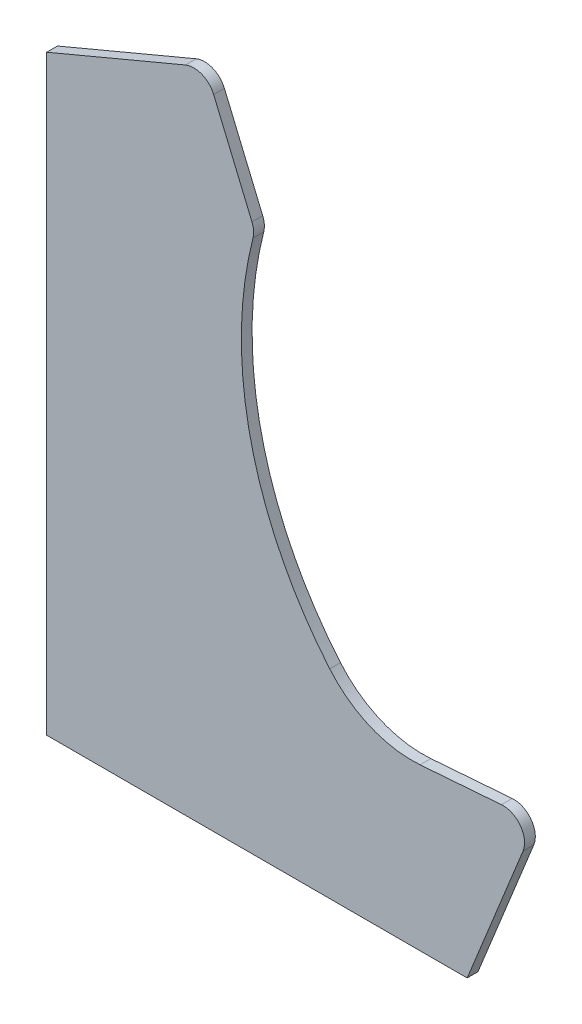
ISO-10303-21;
HEADER;
FILE_DESCRIPTION(('STEP AP214'),'2;1');
FILE_NAME('part.step','',(''),(''),'','','');
FILE_SCHEMA(('AUTOMOTIVE_DESIGN { 1 0 10303 214 1 1 1 1 }'));
ENDSEC;
DATA;
#1=APPLICATION_CONTEXT('core data for automotive mechanical design processes');
#2=APPLICATION_PROTOCOL_DEFINITION('international standard','automotive_design',2000,#1);
#3=PRODUCT_CONTEXT('',#1,'mechanical');
#4=PRODUCT('Part','Part','',(#3));
#5=PRODUCT_RELATED_PRODUCT_CATEGORY('part','',(#4));
#6=PRODUCT_DEFINITION_FORMATION('','',#4);
#7=PRODUCT_DEFINITION_CONTEXT('part definition',#1,'design');
#8=PRODUCT_DEFINITION('design','',#6,#7);
#9=PRODUCT_DEFINITION_SHAPE('','',#8);
#10=(LENGTH_UNIT() NAMED_UNIT(*) SI_UNIT(.MILLI.,.METRE.));
#11=(NAMED_UNIT(*) PLANE_ANGLE_UNIT() SI_UNIT($,.RADIAN.));
#12=(NAMED_UNIT(*) SI_UNIT($,.STERADIAN.) SOLID_ANGLE_UNIT());
#13=UNCERTAINTY_MEASURE_WITH_UNIT(LENGTH_MEASURE(1.E-05),#10,'distance_accuracy_value','');
#14=(GEOMETRIC_REPRESENTATION_CONTEXT(3) GLOBAL_UNCERTAINTY_ASSIGNED_CONTEXT((#13)) GLOBAL_UNIT_ASSIGNED_CONTEXT((#10,
#11,#12)) REPRESENTATION_CONTEXT('',''));
#15=CARTESIAN_POINT('',(0.,0.,0.));
#16=DIRECTION('',(0.,0.,1.));
#17=DIRECTION('',(1.,0.,0.));
#18=AXIS2_PLACEMENT_3D('',#15,#16,#17);
#19=CARTESIAN_POINT('',(0.,0.,10.));
#20=DIRECTION('',(0.,1.,0.));
#21=DIRECTION('',(-1.,0.,0.));
#22=AXIS2_PLACEMENT_3D('',#19,#20,#21);
#23=PLANE('',#22);
#24=DIRECTION('',(1.,0.,0.));
#25=VECTOR('',#24,1.);
#26=CARTESIAN_POINT('',(0.,0.,0.));
#27=LINE('',#26,#25);
#28=CARTESIAN_POINT('',(0.,0.,0.));
#29=VERTEX_POINT('',#28);
#30=CARTESIAN_POINT('',(391.,0.,0.));
#31=VERTEX_POINT('',#30);
#32=EDGE_CURVE('E147',#29,#31,#27,.T.);
#33=ORIENTED_EDGE('',*,*,#32,.T.);
#34=DIRECTION('',(0.,0.,-1.));
#35=VECTOR('',#34,1.);
#36=CARTESIAN_POINT('',(391.,0.,10.));
#37=LINE('',#36,#35);
#38=CARTESIAN_POINT('',(391.,0.,10.));
#39=VERTEX_POINT('',#38);
#40=EDGE_CURVE('E11',#39,#31,#37,.T.);
#41=ORIENTED_EDGE('',*,*,#40,.F.);
#42=DIRECTION('',(1.,0.,0.));
#43=VECTOR('',#42,1.);
#44=CARTESIAN_POINT('',(0.,0.,10.));
#45=LINE('',#44,#43);
#46=CARTESIAN_POINT('',(0.,0.,10.));
#47=VERTEX_POINT('',#46);
#48=EDGE_CURVE('E167',#47,#39,#45,.T.);
#49=ORIENTED_EDGE('',*,*,#48,.F.);
#50=DIRECTION('',(0.,0.,-1.));
#51=VECTOR('',#50,1.);
#52=CARTESIAN_POINT('',(0.,0.,10.));
#53=LINE('',#52,#51);
#54=EDGE_CURVE('E143',#47,#29,#53,.T.);
#55=ORIENTED_EDGE('',*,*,#54,.T.);
#56=EDGE_LOOP('',(#33,#41,#49,#55));
#57=FACE_BOUND('',#56,.T.);
#58=ADVANCED_FACE('F33',(#57),#23,.F.);
#59=CARTESIAN_POINT('',(391.,0.,10.));
#60=DIRECTION('',(-0.926771542740174,0.375625488441609,0.));
#61=DIRECTION('',(-0.375625488441609,-0.926771542740174,0.));
#62=AXIS2_PLACEMENT_3D('',#59,#60,#61);
#63=PLANE('',#62);
#64=DIRECTION('',(0.375625488441609,0.926771542740174,0.));
#65=VECTOR('',#64,1.);
#66=CARTESIAN_POINT('',(391.,0.,0.));
#67=LINE('',#66,#65);
#68=CARTESIAN_POINT('',(442.889156646901,128.024841862164,0.));
#69=VERTEX_POINT('',#68);
#70=EDGE_CURVE('E150',#31,#69,#67,.T.);
#71=ORIENTED_EDGE('',*,*,#70,.T.);
#72=DIRECTION('',(0.,0.,-1.));
#73=VECTOR('',#72,1.);
#74=CARTESIAN_POINT('',(442.889156646901,128.024841862164,10.));
#75=LINE('',#74,#73);
#76=CARTESIAN_POINT('',(442.889156646901,128.024841862164,10.));
#77=VERTEX_POINT('',#76);
#78=EDGE_CURVE('E41',#77,#69,#75,.T.);
#79=ORIENTED_EDGE('',*,*,#78,.F.);
#80=DIRECTION('',(0.375625488441609,0.926771542740174,0.));
#81=VECTOR('',#80,1.);
#82=CARTESIAN_POINT('',(391.,0.,10.));
#83=LINE('',#82,#81);
#84=EDGE_CURVE('E101',#39,#77,#83,.T.);
#85=ORIENTED_EDGE('',*,*,#84,.F.);
#86=ORIENTED_EDGE('',*,*,#40,.T.);
#87=EDGE_LOOP('',(#71,#79,#85,#86));
#88=FACE_BOUND('',#87,.T.);
#89=ADVANCED_FACE('F239',(#88),#63,.F.);
#90=CARTESIAN_POINT('',(424.353725792098,135.537351630996,10.));
#91=DIRECTION('',(0.,0.,-1.));
#92=DIRECTION('',(-1.,0.,0.));
#93=AXIS2_PLACEMENT_3D('',#90,#91,#92);
#94=CYLINDRICAL_SURFACE('',#93,20.);
#95=CARTESIAN_POINT('',(424.353725792098,135.537351630996,0.));
#96=DIRECTION('',(0.,0.,1.));
#97=DIRECTION('',(-1.,0.,0.));
#98=AXIS2_PLACEMENT_3D('',#95,#96,#97);
#99=CIRCLE('',#98,20.);
#100=CARTESIAN_POINT('',(422.849515253651,155.480705176878,0.));
#101=VERTEX_POINT('',#100);
#102=EDGE_CURVE('E152',#69,#101,#99,.T.);
#103=ORIENTED_EDGE('',*,*,#102,.T.);
#104=DIRECTION('',(0.,0.,-1.));
#105=VECTOR('',#104,1.);
#106=CARTESIAN_POINT('',(422.849515253651,155.480705176878,10.));
#107=LINE('',#106,#105);
#108=CARTESIAN_POINT('',(422.849515253651,155.480705176878,10.));
#109=VERTEX_POINT('',#108);
#110=EDGE_CURVE('E183',#109,#101,#107,.T.);
#111=ORIENTED_EDGE('',*,*,#110,.F.);
#112=CARTESIAN_POINT('',(424.353725792098,135.537351630996,10.));
#113=DIRECTION('',(0.,0.,1.));
#114=DIRECTION('',(-1.,0.,0.));
#115=AXIS2_PLACEMENT_3D('',#112,#113,#114);
#116=CIRCLE('',#115,20.);
#117=EDGE_CURVE('E191',#77,#109,#116,.T.);
#118=ORIENTED_EDGE('',*,*,#117,.F.);
#119=ORIENTED_EDGE('',*,*,#78,.T.);
#120=EDGE_LOOP('',(#103,#111,#118,#119));
#121=FACE_BOUND('',#120,.T.);
#122=ADVANCED_FACE('F189',(#121),#94,.T.);
#123=CARTESIAN_POINT('',(422.849515253651,155.480705176878,10.));
#124=DIRECTION('',(0.0752105269223486,-0.997167677294076,0.));
#125=DIRECTION('',(0.997167677294076,0.0752105269223486,0.));
#126=AXIS2_PLACEMENT_3D('',#123,#124,#125);
#127=PLANE('',#126);
#128=DIRECTION('',(-0.997167677294076,-0.0752105269223486,0.));
#129=VECTOR('',#128,1.);
#130=CARTESIAN_POINT('',(422.849515253651,155.480705176878,0.));
#131=LINE('',#130,#129);
#132=CARTESIAN_POINT('',(347.160451011793,149.771921655798,0.));
#133=VERTEX_POINT('',#132);
#134=EDGE_CURVE('E154',#101,#133,#131,.T.);
#135=ORIENTED_EDGE('',*,*,#134,.T.);
#136=DIRECTION('',(0.,0.,-1.));
#137=VECTOR('',#136,1.);
#138=CARTESIAN_POINT('',(347.160451011793,149.771921655798,10.));
#139=LINE('',#138,#137);
#140=CARTESIAN_POINT('',(347.160451011793,149.771921655798,10.));
#141=VERTEX_POINT('',#140);
#142=EDGE_CURVE('E180',#141,#133,#139,.T.);
#143=ORIENTED_EDGE('',*,*,#142,.F.);
#144=DIRECTION('',(-0.997167677294076,-0.0752105269223486,0.));
#145=VECTOR('',#144,1.);
#146=CARTESIAN_POINT('',(422.849515253651,155.480705176878,10.));
#147=LINE('',#146,#145);
#148=EDGE_CURVE('E209',#109,#141,#147,.T.);
#149=ORIENTED_EDGE('',*,*,#148,.F.);
#150=ORIENTED_EDGE('',*,*,#110,.T.);
#151=EDGE_LOOP('',(#135,#143,#149,#150));
#152=FACE_BOUND('',#151,.T.);
#153=ADVANCED_FACE('F200',(#152),#127,.F.);
#154=CARTESIAN_POINT('',(339.639398319558,249.488689385206,10.));
#155=DIRECTION('',(0.,0.,-1.));
#156=DIRECTION('',(-1.,0.,0.));
#157=AXIS2_PLACEMENT_3D('',#154,#155,#156);
#158=CYLINDRICAL_SURFACE('',#157,100.);
#159=CARTESIAN_POINT('',(339.639398319558,249.488689385206,0.));
#160=DIRECTION('',(0.,0.,-1.));
#161=DIRECTION('',(-1.,0.,0.));
#162=AXIS2_PLACEMENT_3D('',#159,#160,#161);
#163=CIRCLE('',#162,100.);
#164=CARTESIAN_POINT('',(263.189381841246,185.026336182226,0.));
#165=VERTEX_POINT('',#164);
#166=EDGE_CURVE('E156',#133,#165,#163,.T.);
#167=ORIENTED_EDGE('',*,*,#166,.T.);
#168=DIRECTION('',(0.,0.,-1.));
#169=VECTOR('',#168,1.);
#170=CARTESIAN_POINT('',(263.189381841246,185.026336182226,10.));
#171=LINE('',#170,#169);
#172=CARTESIAN_POINT('',(263.189381841246,185.026336182226,10.));
#173=VERTEX_POINT('',#172);
#174=EDGE_CURVE('E177',#173,#165,#171,.T.);
#175=ORIENTED_EDGE('',*,*,#174,.F.);
#176=CARTESIAN_POINT('',(339.639398319558,249.488689385206,10.));
#177=DIRECTION('',(0.,0.,-1.));
#178=DIRECTION('',(-1.,0.,0.));
#179=AXIS2_PLACEMENT_3D('',#176,#177,#178);
#180=CIRCLE('',#179,100.);
#181=EDGE_CURVE('E206',#141,#173,#180,.T.);
#182=ORIENTED_EDGE('',*,*,#181,.F.);
#183=ORIENTED_EDGE('',*,*,#142,.T.);
#184=EDGE_LOOP('',(#167,#175,#182,#183));
#185=FACE_BOUND('',#184,.T.);
#186=ADVANCED_FACE('F204',(#185),#158,.F.);
#187=CARTESIAN_POINT('',(530.,410.,10.));
#188=DIRECTION('',(0.,0.,-1.));
#189=DIRECTION('',(-1.,0.,0.));
#190=AXIS2_PLACEMENT_3D('',#187,#188,#189);
#191=CYLINDRICAL_SURFACE('',#190,349.000079332154);
#192=CARTESIAN_POINT('',(530.,410.,0.));
#193=DIRECTION('',(0.,0.,-1.));
#194=DIRECTION('',(1.,0.,0.));
#195=AXIS2_PLACEMENT_3D('',#192,#193,#194);
#196=CIRCLE('',#195,349.000079332154);
#197=CARTESIAN_POINT('',(191.802553763964,496.15998336393,0.));
#198=VERTEX_POINT('',#197);
#199=EDGE_CURVE('E158',#165,#198,#196,.T.);
#200=ORIENTED_EDGE('',*,*,#199,.T.);
#201=DIRECTION('',(0.,0.,-1.));
#202=VECTOR('',#201,1.);
#203=CARTESIAN_POINT('',(191.802553763964,496.15998336393,10.));
#204=LINE('',#203,#202);
#205=CARTESIAN_POINT('',(191.802553763964,496.15998336393,10.));
#206=VERTEX_POINT('',#205);
#207=EDGE_CURVE('E174',#206,#198,#204,.T.);
#208=ORIENTED_EDGE('',*,*,#207,.F.);
#209=CARTESIAN_POINT('',(530.,410.,10.));
#210=DIRECTION('',(0.,0.,-1.));
#211=DIRECTION('',(1.,0.,0.));
#212=AXIS2_PLACEMENT_3D('',#209,#210,#211);
#213=CIRCLE('',#212,349.000079332154);
#214=EDGE_CURVE('E208',#173,#206,#213,.T.);
#215=ORIENTED_EDGE('',*,*,#214,.F.);
#216=ORIENTED_EDGE('',*,*,#174,.T.);
#217=EDGE_LOOP('',(#200,#208,#215,#216));
#218=FACE_BOUND('',#217,.T.);
#219=ADVANCED_FACE('F252',(#218),#191,.F.);
#220=CARTESIAN_POINT('',(172.421615691788,501.097517104828,10.));
#221=DIRECTION('',(0.,0.,-1.));
#222=DIRECTION('',(-1.,0.,0.));
#223=AXIS2_PLACEMENT_3D('',#220,#221,#222);
#224=CYLINDRICAL_SURFACE('',#223,20.0000000000001);
#225=CARTESIAN_POINT('',(172.421615691788,501.097517104828,0.));
#226=DIRECTION('',(0.,0.,1.));
#227=DIRECTION('',(1.,0.,0.));
#228=AXIS2_PLACEMENT_3D('',#225,#226,#227);
#229=CIRCLE('',#228,20.0000000000001);
#230=CARTESIAN_POINT('',(190.859025665592,508.847479263309,0.));
#231=VERTEX_POINT('',#230);
#232=EDGE_CURVE('E160',#198,#231,#229,.T.);
#233=ORIENTED_EDGE('',*,*,#232,.T.);
#234=DIRECTION('',(0.,0.,-1.));
#235=VECTOR('',#234,1.);
#236=CARTESIAN_POINT('',(190.859025665592,508.847479263309,10.));
#237=LINE('',#236,#235);
#238=CARTESIAN_POINT('',(190.859025665592,508.847479263309,10.));
#239=VERTEX_POINT('',#238);
#240=EDGE_CURVE('E171',#239,#231,#237,.T.);
#241=ORIENTED_EDGE('',*,*,#240,.F.);
#242=CARTESIAN_POINT('',(172.421615691788,501.097517104828,10.));
#243=DIRECTION('',(0.,0.,1.));
#244=DIRECTION('',(1.,0.,0.));
#245=AXIS2_PLACEMENT_3D('',#242,#243,#244);
#246=CIRCLE('',#245,20.0000000000001);
#247=EDGE_CURVE('E211',#206,#239,#246,.T.);
#248=ORIENTED_EDGE('',*,*,#247,.F.);
#249=ORIENTED_EDGE('',*,*,#207,.T.);
#250=EDGE_LOOP('',(#233,#241,#248,#249));
#251=FACE_BOUND('',#250,.T.);
#252=ADVANCED_FACE('F220',(#251),#224,.T.);
#253=CARTESIAN_POINT('',(155.24996215848,593.562590026196,10.));
#254=DIRECTION('',(-0.921870498690195,-0.387498107924015,0.));
#255=DIRECTION('',(0.387498107924015,-0.921870498690195,0.));
#256=AXIS2_PLACEMENT_3D('',#253,#254,#255);
#257=PLANE('',#256);
#258=DIRECTION('',(-0.387498107924015,0.921870498690195,0.));
#259=VECTOR('',#258,1.);
#260=CARTESIAN_POINT('',(155.24996215848,593.562590026196,0.));
#261=LINE('',#260,#259);
#262=CARTESIAN_POINT('',(155.24996215848,593.562590026196,0.));
#263=VERTEX_POINT('',#262);
#264=EDGE_CURVE('E162',#231,#263,#261,.T.);
#265=ORIENTED_EDGE('',*,*,#264,.T.);
#266=DIRECTION('',(0.,0.,-1.));
#267=VECTOR('',#266,1.);
#268=CARTESIAN_POINT('',(155.24996215848,593.562590026196,10.));
#269=LINE('',#268,#267);
#270=CARTESIAN_POINT('',(155.24996215848,593.562590026196,10.));
#271=VERTEX_POINT('',#270);
#272=EDGE_CURVE('E138',#271,#263,#269,.T.);
#273=ORIENTED_EDGE('',*,*,#272,.F.);
#274=DIRECTION('',(-0.387498107924015,0.921870498690195,0.));
#275=VECTOR('',#274,1.);
#276=CARTESIAN_POINT('',(155.24996215848,593.562590026196,10.));
#277=LINE('',#276,#275);
#278=EDGE_CURVE('E129',#239,#271,#277,.T.);
#279=ORIENTED_EDGE('',*,*,#278,.F.);
#280=ORIENTED_EDGE('',*,*,#240,.T.);
#281=EDGE_LOOP('',(#265,#273,#279,#280));
#282=FACE_BOUND('',#281,.T.);
#283=ADVANCED_FACE('F224',(#282),#257,.F.);
#284=CARTESIAN_POINT('',(136.812552184676,585.812627867716,10.));
#285=DIRECTION('',(0.,0.,-1.));
#286=DIRECTION('',(-1.,0.,0.));
#287=AXIS2_PLACEMENT_3D('',#284,#285,#286);
#288=CYLINDRICAL_SURFACE('',#287,20.);
#289=CARTESIAN_POINT('',(136.812552184676,585.812627867716,0.));
#290=DIRECTION('',(0.,0.,1.));
#291=DIRECTION('',(1.,0.,0.));
#292=AXIS2_PLACEMENT_3D('',#289,#290,#291);
#293=CIRCLE('',#292,20.);
#294=CARTESIAN_POINT('',(129.062590026196,604.25003784152,0.));
#295=VERTEX_POINT('',#294);
#296=EDGE_CURVE('E137',#263,#295,#293,.T.);
#297=ORIENTED_EDGE('',*,*,#296,.T.);
#298=DIRECTION('',(0.,0.,-1.));
#299=VECTOR('',#298,1.);
#300=CARTESIAN_POINT('',(129.062590026196,604.25003784152,10.));
#301=LINE('',#300,#299);
#302=CARTESIAN_POINT('',(129.062590026196,604.25003784152,10.));
#303=VERTEX_POINT('',#302);
#304=EDGE_CURVE('E134',#303,#295,#301,.T.);
#305=ORIENTED_EDGE('',*,*,#304,.F.);
#306=CARTESIAN_POINT('',(136.812552184676,585.812627867716,10.));
#307=DIRECTION('',(0.,0.,1.));
#308=DIRECTION('',(1.,0.,0.));
#309=AXIS2_PLACEMENT_3D('',#306,#307,#308);
#310=CIRCLE('',#309,20.);
#311=EDGE_CURVE('E123',#271,#303,#310,.T.);
#312=ORIENTED_EDGE('',*,*,#311,.F.);
#313=ORIENTED_EDGE('',*,*,#272,.T.);
#314=EDGE_LOOP('',(#297,#305,#312,#313));
#315=FACE_BOUND('',#314,.T.);
#316=ADVANCED_FACE('F135',(#315),#288,.T.);
#317=CARTESIAN_POINT('',(0.,550.,10.));
#318=DIRECTION('',(0.387498107924014,-0.921870498690195,0.));
#319=DIRECTION('',(0.921870498690195,0.387498107924014,0.));
#320=AXIS2_PLACEMENT_3D('',#317,#318,#319);
#321=PLANE('',#320);
#322=DIRECTION('',(-0.921870498690195,-0.387498107924014,0.));
#323=VECTOR('',#322,1.);
#324=CARTESIAN_POINT('',(0.,550.,0.));
#325=LINE('',#324,#323);
#326=CARTESIAN_POINT('',(0.,550.,0.));
#327=VERTEX_POINT('',#326);
#328=EDGE_CURVE('E87',#295,#327,#325,.T.);
#329=ORIENTED_EDGE('',*,*,#328,.T.);
#330=DIRECTION('',(0.,0.,-1.));
#331=VECTOR('',#330,1.);
#332=CARTESIAN_POINT('',(0.,550.,10.));
#333=LINE('',#332,#331);
#334=CARTESIAN_POINT('',(0.,550.,10.));
#335=VERTEX_POINT('',#334);
#336=EDGE_CURVE('E139',#335,#327,#333,.T.);
#337=ORIENTED_EDGE('',*,*,#336,.F.);
#338=DIRECTION('',(-0.921870498690195,-0.387498107924014,0.));
#339=VECTOR('',#338,1.);
#340=CARTESIAN_POINT('',(0.,550.,10.));
#341=LINE('',#340,#339);
#342=EDGE_CURVE('E127',#303,#335,#341,.T.);
#343=ORIENTED_EDGE('',*,*,#342,.F.);
#344=ORIENTED_EDGE('',*,*,#304,.T.);
#345=EDGE_LOOP('',(#329,#337,#343,#344));
#346=FACE_BOUND('',#345,.T.);
#347=ADVANCED_FACE('F141',(#346),#321,.F.);
#348=CARTESIAN_POINT('',(0.,0.,10.));
#349=DIRECTION('',(1.,0.,0.));
#350=DIRECTION('',(0.,0.,-1.));
#351=AXIS2_PLACEMENT_3D('',#348,#349,#350);
#352=PLANE('',#351);
#353=DIRECTION('',(0.,-1.,0.));
#354=VECTOR('',#353,1.);
#355=CARTESIAN_POINT('',(0.,0.,0.));
#356=LINE('',#355,#354);
#357=EDGE_CURVE('E93',#327,#29,#356,.T.);
#358=ORIENTED_EDGE('',*,*,#357,.T.);
#359=ORIENTED_EDGE('',*,*,#54,.F.);
#360=DIRECTION('',(0.,-1.,0.));
#361=VECTOR('',#360,1.);
#362=CARTESIAN_POINT('',(0.,0.,10.));
#363=LINE('',#362,#361);
#364=EDGE_CURVE('E49',#335,#47,#363,.T.);
#365=ORIENTED_EDGE('',*,*,#364,.F.);
#366=ORIENTED_EDGE('',*,*,#336,.T.);
#367=EDGE_LOOP('',(#358,#359,#365,#366));
#368=FACE_BOUND('',#367,.T.);
#369=ADVANCED_FACE('F228',(#368),#352,.F.);
#370=CARTESIAN_POINT('',(424.353725792098,135.537351630996,10.));
#371=DIRECTION('',(0.,0.,-1.));
#372=DIRECTION('',(-1.,0.,0.));
#373=AXIS2_PLACEMENT_3D('',#370,#371,#372);
#374=PLANE('',#373);
#375=ORIENTED_EDGE('',*,*,#48,.T.);
#376=ORIENTED_EDGE('',*,*,#84,.T.);
#377=ORIENTED_EDGE('',*,*,#117,.T.);
#378=ORIENTED_EDGE('',*,*,#148,.T.);
#379=ORIENTED_EDGE('',*,*,#181,.T.);
#380=ORIENTED_EDGE('',*,*,#214,.T.);
#381=ORIENTED_EDGE('',*,*,#247,.T.);
#382=ORIENTED_EDGE('',*,*,#278,.T.);
#383=ORIENTED_EDGE('',*,*,#311,.T.);
#384=ORIENTED_EDGE('',*,*,#342,.T.);
#385=ORIENTED_EDGE('',*,*,#364,.T.);
#386=EDGE_LOOP('',(#375,#376,#377,#378,#379,#380,#381,#382,#383,#384,#385));
#387=FACE_BOUND('',#386,.T.);
#388=ADVANCED_FACE('F125',(#387),#374,.F.);
#389=CARTESIAN_POINT('',(424.353725792098,135.537351630996,0.));
#390=DIRECTION('',(0.,0.,-1.));
#391=DIRECTION('',(-1.,0.,0.));
#392=AXIS2_PLACEMENT_3D('',#389,#390,#391);
#393=PLANE('',#392);
#394=ORIENTED_EDGE('',*,*,#32,.F.);
#395=ORIENTED_EDGE('',*,*,#357,.F.);
#396=ORIENTED_EDGE('',*,*,#328,.F.);
#397=ORIENTED_EDGE('',*,*,#296,.F.);
#398=ORIENTED_EDGE('',*,*,#264,.F.);
#399=ORIENTED_EDGE('',*,*,#232,.F.);
#400=ORIENTED_EDGE('',*,*,#199,.F.);
#401=ORIENTED_EDGE('',*,*,#166,.F.);
#402=ORIENTED_EDGE('',*,*,#134,.F.);
#403=ORIENTED_EDGE('',*,*,#102,.F.);
#404=ORIENTED_EDGE('',*,*,#70,.F.);
#405=EDGE_LOOP('',(#394,#395,#396,#397,#398,#399,#400,#401,#402,#403,#404));
#406=FACE_BOUND('',#405,.T.);
#407=ADVANCED_FACE('F195',(#406),#393,.T.);
#408=CLOSED_SHELL('',(#58,#89,#122,#153,#186,#219,#252,#283,#316,#347,#369,#388,#407));
#409=MANIFOLD_SOLID_BREP('B2',#408);
#410=ADVANCED_BREP_SHAPE_REPRESENTATION('',(#18,#409),#14);
#411=SHAPE_DEFINITION_REPRESENTATION(#9,#410);
ENDSEC;
END-ISO-10303-21;
